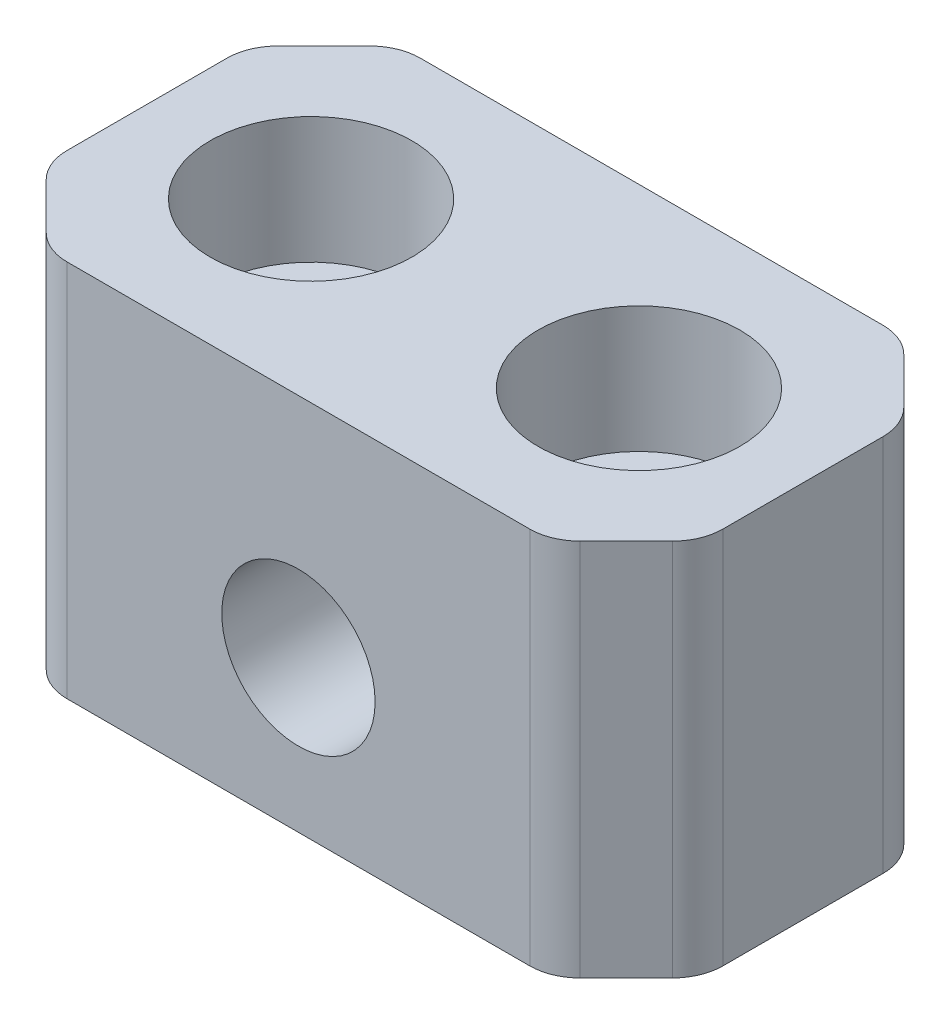
ISO-10303-21;
HEADER;
FILE_DESCRIPTION(('STEP AP214'),'2;1');
FILE_NAME('part.step','',(''),(''),'','','');
FILE_SCHEMA(('AUTOMOTIVE_DESIGN { 1 0 10303 214 1 1 1 1 }'));
ENDSEC;
DATA;
#1=APPLICATION_CONTEXT('core data for automotive mechanical design processes');
#2=APPLICATION_PROTOCOL_DEFINITION('international standard','automotive_design',2000,#1);
#3=PRODUCT_CONTEXT('',#1,'mechanical');
#4=PRODUCT('Part','Part','',(#3));
#5=PRODUCT_RELATED_PRODUCT_CATEGORY('part','',(#4));
#6=PRODUCT_DEFINITION_FORMATION('','',#4);
#7=PRODUCT_DEFINITION_CONTEXT('part definition',#1,'design');
#8=PRODUCT_DEFINITION('design','',#6,#7);
#9=PRODUCT_DEFINITION_SHAPE('','',#8);
#10=(LENGTH_UNIT() NAMED_UNIT(*) SI_UNIT(.MILLI.,.METRE.));
#11=(NAMED_UNIT(*) PLANE_ANGLE_UNIT() SI_UNIT($,.RADIAN.));
#12=(NAMED_UNIT(*) SI_UNIT($,.STERADIAN.) SOLID_ANGLE_UNIT());
#13=UNCERTAINTY_MEASURE_WITH_UNIT(LENGTH_MEASURE(1.E-05),#10,'distance_accuracy_value','');
#14=(GEOMETRIC_REPRESENTATION_CONTEXT(3) GLOBAL_UNCERTAINTY_ASSIGNED_CONTEXT((#13)) GLOBAL_UNIT_ASSIGNED_CONTEXT((#10,
#11,#12)) REPRESENTATION_CONTEXT('',''));
#15=CARTESIAN_POINT('',(0.,0.,0.));
#16=DIRECTION('',(0.,0.,1.));
#17=DIRECTION('',(1.,0.,0.));
#18=AXIS2_PLACEMENT_3D('',#15,#16,#17);
#19=CARTESIAN_POINT('',(-13.,7.5,-7.));
#20=DIRECTION('',(0.,0.,1.));
#21=DIRECTION('',(1.,0.,0.));
#22=AXIS2_PLACEMENT_3D('',#19,#20,#21);
#23=PLANE('',#22);
#24=DIRECTION('',(1.,0.,0.));
#25=VECTOR('',#24,1.);
#26=CARTESIAN_POINT('',(13.,-7.5,-7.));
#27=LINE('',#26,#25);
#28=CARTESIAN_POINT('',(-9.1715728752538,-7.5,-7.));
#29=VERTEX_POINT('',#28);
#30=CARTESIAN_POINT('',(9.1715728752538,-7.5,-7.));
#31=VERTEX_POINT('',#30);
#32=EDGE_CURVE('E170',#29,#31,#27,.T.);
#33=ORIENTED_EDGE('',*,*,#32,.F.);
#34=DIRECTION('',(0.,1.,0.));
#35=VECTOR('',#34,1.);
#36=CARTESIAN_POINT('',(-9.1715728752538,7.5,-7.));
#37=LINE('',#36,#35);
#38=CARTESIAN_POINT('',(-9.1715728752538,7.5,-7.));
#39=VERTEX_POINT('',#38);
#40=EDGE_CURVE('E168',#29,#39,#37,.T.);
#41=ORIENTED_EDGE('',*,*,#40,.T.);
#42=DIRECTION('',(-1.,0.,0.));
#43=VECTOR('',#42,1.);
#44=CARTESIAN_POINT('',(13.,7.5,-7.));
#45=LINE('',#44,#43);
#46=CARTESIAN_POINT('',(9.1715728752538,7.5,-7.));
#47=VERTEX_POINT('',#46);
#48=EDGE_CURVE('E151',#47,#39,#45,.T.);
#49=ORIENTED_EDGE('',*,*,#48,.F.);
#50=DIRECTION('',(0.,-1.,0.));
#51=VECTOR('',#50,1.);
#52=CARTESIAN_POINT('',(9.1715728752538,-7.5,-7.));
#53=LINE('',#52,#51);
#54=EDGE_CURVE('E165',#47,#31,#53,.T.);
#55=ORIENTED_EDGE('',*,*,#54,.T.);
#56=EDGE_LOOP('',(#33,#41,#49,#55));
#57=FACE_BOUND('',#56,.T.);
#58=CARTESIAN_POINT('',(0.,-1.5,-7.));
#59=DIRECTION('',(0.,0.,1.));
#60=DIRECTION('',(1.,0.,0.));
#61=AXIS2_PLACEMENT_3D('',#58,#59,#60);
#62=CIRCLE('',#61,3.04);
#63=CARTESIAN_POINT('',(3.04,-1.5,-7.));
#64=VERTEX_POINT('',#63);
#65=EDGE_CURVE('E269',#64,#64,#62,.T.);
#66=ORIENTED_EDGE('',*,*,#65,.T.);
#67=EDGE_LOOP('',(#66));
#68=FACE_BOUND('',#67,.T.);
#69=ADVANCED_FACE('F32',(#57,#68),#23,.F.);
#70=CARTESIAN_POINT('',(-13.,7.5,7.));
#71=DIRECTION('',(0.,0.,1.));
#72=DIRECTION('',(1.,0.,0.));
#73=AXIS2_PLACEMENT_3D('',#70,#71,#72);
#74=PLANE('',#73);
#75=DIRECTION('',(1.,0.,0.));
#76=VECTOR('',#75,1.);
#77=CARTESIAN_POINT('',(13.,-7.5,7.));
#78=LINE('',#77,#76);
#79=CARTESIAN_POINT('',(-9.1715728752538,-7.5,7.));
#80=VERTEX_POINT('',#79);
#81=CARTESIAN_POINT('',(9.17157287525381,-7.5,7.));
#82=VERTEX_POINT('',#81);
#83=EDGE_CURVE('E258',#80,#82,#78,.T.);
#84=ORIENTED_EDGE('',*,*,#83,.T.);
#85=DIRECTION('',(0.,-1.,0.));
#86=VECTOR('',#85,1.);
#87=CARTESIAN_POINT('',(9.17157287525381,7.5,7.));
#88=LINE('',#87,#86);
#89=CARTESIAN_POINT('',(9.17157287525381,7.5,7.));
#90=VERTEX_POINT('',#89);
#91=EDGE_CURVE('E233',#82,#90,#88,.F.);
#92=ORIENTED_EDGE('',*,*,#91,.T.);
#93=DIRECTION('',(-1.,0.,0.));
#94=VECTOR('',#93,1.);
#95=CARTESIAN_POINT('',(13.,7.5,7.));
#96=LINE('',#95,#94);
#97=CARTESIAN_POINT('',(-9.1715728752538,7.5,7.));
#98=VERTEX_POINT('',#97);
#99=EDGE_CURVE('E260',#90,#98,#96,.T.);
#100=ORIENTED_EDGE('',*,*,#99,.T.);
#101=DIRECTION('',(0.,1.,0.));
#102=VECTOR('',#101,1.);
#103=CARTESIAN_POINT('',(-9.17157287525381,7.5,7.));
#104=LINE('',#103,#102);
#105=EDGE_CURVE('E230',#98,#80,#104,.F.);
#106=ORIENTED_EDGE('',*,*,#105,.T.);
#107=EDGE_LOOP('',(#84,#92,#100,#106));
#108=FACE_BOUND('',#107,.T.);
#109=CARTESIAN_POINT('',(0.,-1.5,7.));
#110=DIRECTION('',(0.,0.,1.));
#111=DIRECTION('',(1.,0.,0.));
#112=AXIS2_PLACEMENT_3D('',#109,#110,#111);
#113=CIRCLE('',#112,3.04);
#114=CARTESIAN_POINT('',(3.04,-1.5,7.));
#115=VERTEX_POINT('',#114);
#116=EDGE_CURVE('E265',#115,#115,#113,.T.);
#117=ORIENTED_EDGE('',*,*,#116,.F.);
#118=EDGE_LOOP('',(#117));
#119=FACE_BOUND('',#118,.T.);
#120=ADVANCED_FACE('F256',(#108,#119),#74,.T.);
#121=CARTESIAN_POINT('',(-13.,-7.5,-7.));
#122=DIRECTION('',(-1.,0.,0.));
#123=DIRECTION('',(0.,0.,1.));
#124=AXIS2_PLACEMENT_3D('',#121,#122,#123);
#125=PLANE('',#124);
#126=DIRECTION('',(0.,0.,1.));
#127=VECTOR('',#126,1.);
#128=CARTESIAN_POINT('',(-13.,7.5,-7.));
#129=LINE('',#128,#127);
#130=CARTESIAN_POINT('',(-13.,7.5,-3.17157287525381));
#131=VERTEX_POINT('',#130);
#132=CARTESIAN_POINT('',(-13.,7.5,3.1715728752538));
#133=VERTEX_POINT('',#132);
#134=EDGE_CURVE('E250',#131,#133,#129,.T.);
#135=ORIENTED_EDGE('',*,*,#134,.F.);
#136=DIRECTION('',(0.,-1.,0.));
#137=VECTOR('',#136,1.);
#138=CARTESIAN_POINT('',(-13.,-7.5,-3.17157287525381));
#139=LINE('',#138,#137);
#140=CARTESIAN_POINT('',(-13.,-7.5,-3.17157287525381));
#141=VERTEX_POINT('',#140);
#142=EDGE_CURVE('E214',#131,#141,#139,.T.);
#143=ORIENTED_EDGE('',*,*,#142,.T.);
#144=DIRECTION('',(0.,0.,1.));
#145=VECTOR('',#144,1.);
#146=CARTESIAN_POINT('',(-13.,-7.5,-7.));
#147=LINE('',#146,#145);
#148=CARTESIAN_POINT('',(-13.,-7.5,3.1715728752538));
#149=VERTEX_POINT('',#148);
#150=EDGE_CURVE('E169',#141,#149,#147,.T.);
#151=ORIENTED_EDGE('',*,*,#150,.T.);
#152=DIRECTION('',(0.,-1.,0.));
#153=VECTOR('',#152,1.);
#154=CARTESIAN_POINT('',(-13.,-7.5,3.1715728752538));
#155=LINE('',#154,#153);
#156=EDGE_CURVE('E211',#149,#133,#155,.F.);
#157=ORIENTED_EDGE('',*,*,#156,.T.);
#158=EDGE_LOOP('',(#135,#143,#151,#157));
#159=FACE_BOUND('',#158,.T.);
#160=ADVANCED_FACE('F326',(#159),#125,.T.);
#161=CARTESIAN_POINT('',(13.,7.5,-7.));
#162=DIRECTION('',(0.,1.,0.));
#163=DIRECTION('',(-1.,0.,0.));
#164=AXIS2_PLACEMENT_3D('',#161,#162,#163);
#165=PLANE('',#164);
#166=CARTESIAN_POINT('',(6.5,7.5,0.));
#167=DIRECTION('',(0.,1.,0.));
#168=DIRECTION('',(0.,0.,-1.));
#169=AXIS2_PLACEMENT_3D('',#166,#167,#168);
#170=CIRCLE('',#169,4.);
#171=CARTESIAN_POINT('',(6.5,7.5,-4.));
#172=VERTEX_POINT('',#171);
#173=EDGE_CURVE('E471',#172,#172,#170,.T.);
#174=ORIENTED_EDGE('',*,*,#173,.F.);
#175=EDGE_LOOP('',(#174));
#176=FACE_BOUND('',#175,.T.);
#177=CARTESIAN_POINT('',(-6.5,7.5,0.));
#178=DIRECTION('',(0.,1.,0.));
#179=DIRECTION('',(0.,0.,1.));
#180=AXIS2_PLACEMENT_3D('',#177,#178,#179);
#181=CIRCLE('',#180,4.00000000000001);
#182=CARTESIAN_POINT('',(-6.5,7.5,4.00000000000001));
#183=VERTEX_POINT('',#182);
#184=EDGE_CURVE('E465',#183,#183,#181,.T.);
#185=ORIENTED_EDGE('',*,*,#184,.F.);
#186=EDGE_LOOP('',(#185));
#187=FACE_BOUND('',#186,.T.);
#188=ORIENTED_EDGE('',*,*,#48,.T.);
#189=CARTESIAN_POINT('',(-9.1715728752538,7.5,-5.));
#190=DIRECTION('',(0.,1.,0.));
#191=DIRECTION('',(-1.,0.,0.));
#192=AXIS2_PLACEMENT_3D('',#189,#190,#191);
#193=CIRCLE('',#192,2.);
#194=CARTESIAN_POINT('',(-10.5857864376269,7.5,-6.4142135623731));
#195=VERTEX_POINT('',#194);
#196=EDGE_CURVE('E192',#39,#195,#193,.T.);
#197=ORIENTED_EDGE('',*,*,#196,.T.);
#198=DIRECTION('',(-0.707106781186549,0.,0.707106781186546));
#199=VECTOR('',#198,1.);
#200=CARTESIAN_POINT('',(1.50000000000004,7.5,-18.5));
#201=LINE('',#200,#199);
#202=CARTESIAN_POINT('',(-12.4142135623731,7.5,-4.5857864376269));
#203=VERTEX_POINT('',#202);
#204=EDGE_CURVE('E249',#195,#203,#201,.T.);
#205=ORIENTED_EDGE('',*,*,#204,.T.);
#206=CARTESIAN_POINT('',(-11.,7.5,-3.17157287525381));
#207=DIRECTION('',(0.,1.,0.));
#208=DIRECTION('',(-1.,0.,0.));
#209=AXIS2_PLACEMENT_3D('',#206,#207,#208);
#210=CIRCLE('',#209,2.);
#211=EDGE_CURVE('E157',#203,#131,#210,.T.);
#212=ORIENTED_EDGE('',*,*,#211,.T.);
#213=ORIENTED_EDGE('',*,*,#134,.T.);
#214=CARTESIAN_POINT('',(-11.,7.5,3.1715728752538));
#215=DIRECTION('',(0.,1.,0.));
#216=DIRECTION('',(-1.,0.,0.));
#217=AXIS2_PLACEMENT_3D('',#214,#215,#216);
#218=CIRCLE('',#217,2.);
#219=CARTESIAN_POINT('',(-12.4142135623731,7.5,4.58578643762689));
#220=VERTEX_POINT('',#219);
#221=EDGE_CURVE('E184',#133,#220,#218,.T.);
#222=ORIENTED_EDGE('',*,*,#221,.T.);
#223=DIRECTION('',(-0.707106781186546,0.,-0.707106781186549));
#224=VECTOR('',#223,1.);
#225=CARTESIAN_POINT('',(-5.50000000000004,7.5,11.5));
#226=LINE('',#225,#224);
#227=CARTESIAN_POINT('',(-10.5857864376269,7.5,6.41421356237309));
#228=VERTEX_POINT('',#227);
#229=EDGE_CURVE('E241',#220,#228,#226,.F.);
#230=ORIENTED_EDGE('',*,*,#229,.T.);
#231=CARTESIAN_POINT('',(-9.17157287525381,7.5,5.));
#232=DIRECTION('',(0.,1.,0.));
#233=DIRECTION('',(-1.,0.,0.));
#234=AXIS2_PLACEMENT_3D('',#231,#232,#233);
#235=CIRCLE('',#234,2.);
#236=EDGE_CURVE('E176',#228,#98,#235,.T.);
#237=ORIENTED_EDGE('',*,*,#236,.T.);
#238=ORIENTED_EDGE('',*,*,#99,.F.);
#239=CARTESIAN_POINT('',(9.17157287525381,7.5,5.));
#240=DIRECTION('',(0.,1.,0.));
#241=DIRECTION('',(-1.,0.,0.));
#242=AXIS2_PLACEMENT_3D('',#239,#240,#241);
#243=CIRCLE('',#242,2.);
#244=CARTESIAN_POINT('',(10.5857864376269,7.5,6.41421356237309));
#245=VERTEX_POINT('',#244);
#246=EDGE_CURVE('E186',#90,#245,#243,.T.);
#247=ORIENTED_EDGE('',*,*,#246,.T.);
#248=DIRECTION('',(-0.707106781186546,0.,0.707106781186549));
#249=VECTOR('',#248,1.);
#250=CARTESIAN_POINT('',(18.5,7.5,-1.50000000000002));
#251=LINE('',#250,#249);
#252=CARTESIAN_POINT('',(12.4142135623731,7.5,4.5857864376269));
#253=VERTEX_POINT('',#252);
#254=EDGE_CURVE('E284',#245,#253,#251,.F.);
#255=ORIENTED_EDGE('',*,*,#254,.T.);
#256=CARTESIAN_POINT('',(11.,7.5,3.17157287525381));
#257=DIRECTION('',(0.,1.,0.));
#258=DIRECTION('',(-1.,0.,0.));
#259=AXIS2_PLACEMENT_3D('',#256,#257,#258);
#260=CIRCLE('',#259,2.);
#261=CARTESIAN_POINT('',(13.,7.5,3.17157287525381));
#262=VERTEX_POINT('',#261);
#263=EDGE_CURVE('E188',#253,#262,#260,.T.);
#264=ORIENTED_EDGE('',*,*,#263,.T.);
#265=DIRECTION('',(0.,0.,1.));
#266=VECTOR('',#265,1.);
#267=CARTESIAN_POINT('',(13.,7.5,-7.));
#268=LINE('',#267,#266);
#269=CARTESIAN_POINT('',(13.,7.5,-3.17157287525381));
#270=VERTEX_POINT('',#269);
#271=EDGE_CURVE('E275',#270,#262,#268,.T.);
#272=ORIENTED_EDGE('',*,*,#271,.F.);
#273=CARTESIAN_POINT('',(11.,7.5,-3.17157287525381));
#274=DIRECTION('',(0.,1.,0.));
#275=DIRECTION('',(-1.,0.,0.));
#276=AXIS2_PLACEMENT_3D('',#273,#274,#275);
#277=CIRCLE('',#276,2.);
#278=CARTESIAN_POINT('',(12.4142135623731,7.5,-4.58578643762691));
#279=VERTEX_POINT('',#278);
#280=EDGE_CURVE('E158',#270,#279,#277,.T.);
#281=ORIENTED_EDGE('',*,*,#280,.T.);
#282=DIRECTION('',(-0.707106781186549,0.,-0.707106781186546));
#283=VECTOR('',#282,1.);
#284=CARTESIAN_POINT('',(11.5,7.5,-5.5));
#285=LINE('',#284,#283);
#286=CARTESIAN_POINT('',(10.5857864376269,7.5,-6.4142135623731));
#287=VERTEX_POINT('',#286);
#288=EDGE_CURVE('E153',#279,#287,#285,.T.);
#289=ORIENTED_EDGE('',*,*,#288,.T.);
#290=CARTESIAN_POINT('',(9.1715728752538,7.5,-5.));
#291=DIRECTION('',(0.,1.,0.));
#292=DIRECTION('',(-1.,0.,0.));
#293=AXIS2_PLACEMENT_3D('',#290,#291,#292);
#294=CIRCLE('',#293,2.);
#295=EDGE_CURVE('E148',#287,#47,#294,.T.);
#296=ORIENTED_EDGE('',*,*,#295,.T.);
#297=EDGE_LOOP('',(#188,#197,#205,#212,#213,#222,#230,#237,#238,#247,#255,#264,#272,#281,#289,#296));
#298=FACE_BOUND('',#297,.T.);
#299=ADVANCED_FACE('F150',(#176,#187,#298),#165,.T.);
#300=CARTESIAN_POINT('',(13.,-7.5,-7.));
#301=DIRECTION('',(1.,0.,0.));
#302=DIRECTION('',(0.,0.,-1.));
#303=AXIS2_PLACEMENT_3D('',#300,#301,#302);
#304=PLANE('',#303);
#305=DIRECTION('',(0.,0.,1.));
#306=VECTOR('',#305,1.);
#307=CARTESIAN_POINT('',(13.,-7.5,-7.));
#308=LINE('',#307,#306);
#309=CARTESIAN_POINT('',(13.,-7.5,-3.17157287525381));
#310=VERTEX_POINT('',#309);
#311=CARTESIAN_POINT('',(13.,-7.5,3.17157287525381));
#312=VERTEX_POINT('',#311);
#313=EDGE_CURVE('E278',#310,#312,#308,.T.);
#314=ORIENTED_EDGE('',*,*,#313,.F.);
#315=DIRECTION('',(0.,1.,0.));
#316=VECTOR('',#315,1.);
#317=CARTESIAN_POINT('',(13.,-7.5,-3.17157287525381));
#318=LINE('',#317,#316);
#319=EDGE_CURVE('E223',#310,#270,#318,.T.);
#320=ORIENTED_EDGE('',*,*,#319,.T.);
#321=ORIENTED_EDGE('',*,*,#271,.T.);
#322=DIRECTION('',(0.,1.,0.));
#323=VECTOR('',#322,1.);
#324=CARTESIAN_POINT('',(13.,-7.5,3.17157287525381));
#325=LINE('',#324,#323);
#326=EDGE_CURVE('E220',#262,#312,#325,.F.);
#327=ORIENTED_EDGE('',*,*,#326,.T.);
#328=EDGE_LOOP('',(#314,#320,#321,#327));
#329=FACE_BOUND('',#328,.T.);
#330=ADVANCED_FACE('F305',(#329),#304,.T.);
#331=CARTESIAN_POINT('',(13.,-7.5,-7.));
#332=DIRECTION('',(0.,-1.,0.));
#333=DIRECTION('',(1.,0.,0.));
#334=AXIS2_PLACEMENT_3D('',#331,#332,#333);
#335=PLANE('',#334);
#336=CARTESIAN_POINT('',(-6.5,-7.5,0.));
#337=DIRECTION('',(0.,1.,0.));
#338=DIRECTION('',(0.,0.,1.));
#339=AXIS2_PLACEMENT_3D('',#336,#337,#338);
#340=CIRCLE('',#339,2.75);
#341=CARTESIAN_POINT('',(-6.5,-7.5,2.75));
#342=VERTEX_POINT('',#341);
#343=EDGE_CURVE('E480',#342,#342,#340,.T.);
#344=ORIENTED_EDGE('',*,*,#343,.T.);
#345=EDGE_LOOP('',(#344));
#346=FACE_BOUND('',#345,.T.);
#347=CARTESIAN_POINT('',(6.5,-7.5,0.));
#348=DIRECTION('',(0.,1.,0.));
#349=DIRECTION('',(0.,0.,1.));
#350=AXIS2_PLACEMENT_3D('',#347,#348,#349);
#351=CIRCLE('',#350,2.75);
#352=CARTESIAN_POINT('',(6.5,-7.5,2.75));
#353=VERTEX_POINT('',#352);
#354=EDGE_CURVE('E474',#353,#353,#351,.T.);
#355=ORIENTED_EDGE('',*,*,#354,.T.);
#356=EDGE_LOOP('',(#355));
#357=FACE_BOUND('',#356,.T.);
#358=DIRECTION('',(0.707106781186549,0.,-0.707106781186546));
#359=VECTOR('',#358,1.);
#360=CARTESIAN_POINT('',(1.50000000000004,-7.5,-18.5));
#361=LINE('',#360,#359);
#362=CARTESIAN_POINT('',(-12.4142135623731,-7.5,-4.5857864376269));
#363=VERTEX_POINT('',#362);
#364=CARTESIAN_POINT('',(-10.5857864376269,-7.5,-6.4142135623731));
#365=VERTEX_POINT('',#364);
#366=EDGE_CURVE('E289',#363,#365,#361,.T.);
#367=ORIENTED_EDGE('',*,*,#366,.T.);
#368=CARTESIAN_POINT('',(-9.1715728752538,-7.5,-5.));
#369=DIRECTION('',(0.,-1.,0.));
#370=DIRECTION('',(1.,0.,0.));
#371=AXIS2_PLACEMENT_3D('',#368,#369,#370);
#372=CIRCLE('',#371,2.);
#373=EDGE_CURVE('E209',#365,#29,#372,.T.);
#374=ORIENTED_EDGE('',*,*,#373,.T.);
#375=ORIENTED_EDGE('',*,*,#32,.T.);
#376=CARTESIAN_POINT('',(9.1715728752538,-7.5,-5.));
#377=DIRECTION('',(0.,-1.,0.));
#378=DIRECTION('',(1.,0.,0.));
#379=AXIS2_PLACEMENT_3D('',#376,#377,#378);
#380=CIRCLE('',#379,2.);
#381=CARTESIAN_POINT('',(10.5857864376269,-7.5,-6.4142135623731));
#382=VERTEX_POINT('',#381);
#383=EDGE_CURVE('E173',#31,#382,#380,.T.);
#384=ORIENTED_EDGE('',*,*,#383,.T.);
#385=DIRECTION('',(0.707106781186549,0.,0.707106781186546));
#386=VECTOR('',#385,1.);
#387=CARTESIAN_POINT('',(11.5,-7.5,-5.5));
#388=LINE('',#387,#386);
#389=CARTESIAN_POINT('',(12.4142135623731,-7.5,-4.58578643762691));
#390=VERTEX_POINT('',#389);
#391=EDGE_CURVE('E174',#382,#390,#388,.T.);
#392=ORIENTED_EDGE('',*,*,#391,.T.);
#393=CARTESIAN_POINT('',(11.,-7.5,-3.17157287525381));
#394=DIRECTION('',(0.,-1.,0.));
#395=DIRECTION('',(1.,0.,0.));
#396=AXIS2_PLACEMENT_3D('',#393,#394,#395);
#397=CIRCLE('',#396,2.);
#398=EDGE_CURVE('E205',#390,#310,#397,.T.);
#399=ORIENTED_EDGE('',*,*,#398,.T.);
#400=ORIENTED_EDGE('',*,*,#313,.T.);
#401=CARTESIAN_POINT('',(11.,-7.5,3.17157287525381));
#402=DIRECTION('',(0.,-1.,0.));
#403=DIRECTION('',(1.,0.,0.));
#404=AXIS2_PLACEMENT_3D('',#401,#402,#403);
#405=CIRCLE('',#404,2.);
#406=CARTESIAN_POINT('',(12.4142135623731,-7.5,4.5857864376269));
#407=VERTEX_POINT('',#406);
#408=EDGE_CURVE('E203',#312,#407,#405,.T.);
#409=ORIENTED_EDGE('',*,*,#408,.T.);
#410=DIRECTION('',(0.707106781186546,0.,-0.707106781186549));
#411=VECTOR('',#410,1.);
#412=CARTESIAN_POINT('',(18.5,-7.5,-1.50000000000002));
#413=LINE('',#412,#411);
#414=CARTESIAN_POINT('',(10.5857864376269,-7.5,6.41421356237309));
#415=VERTEX_POINT('',#414);
#416=EDGE_CURVE('E179',#407,#415,#413,.F.);
#417=ORIENTED_EDGE('',*,*,#416,.T.);
#418=CARTESIAN_POINT('',(9.17157287525381,-7.5,5.));
#419=DIRECTION('',(0.,-1.,0.));
#420=DIRECTION('',(1.,0.,0.));
#421=AXIS2_PLACEMENT_3D('',#418,#419,#420);
#422=CIRCLE('',#421,2.);
#423=EDGE_CURVE('E201',#415,#82,#422,.T.);
#424=ORIENTED_EDGE('',*,*,#423,.T.);
#425=ORIENTED_EDGE('',*,*,#83,.F.);
#426=CARTESIAN_POINT('',(-9.17157287525381,-7.5,5.));
#427=DIRECTION('',(0.,-1.,0.));
#428=DIRECTION('',(1.,0.,0.));
#429=AXIS2_PLACEMENT_3D('',#426,#427,#428);
#430=CIRCLE('',#429,2.);
#431=CARTESIAN_POINT('',(-10.5857864376269,-7.5,6.41421356237309));
#432=VERTEX_POINT('',#431);
#433=EDGE_CURVE('E198',#80,#432,#430,.T.);
#434=ORIENTED_EDGE('',*,*,#433,.T.);
#435=DIRECTION('',(0.707106781186546,0.,0.707106781186549));
#436=VECTOR('',#435,1.);
#437=CARTESIAN_POINT('',(-5.50000000000004,-7.5,11.5));
#438=LINE('',#437,#436);
#439=CARTESIAN_POINT('',(-12.4142135623731,-7.5,4.58578643762689));
#440=VERTEX_POINT('',#439);
#441=EDGE_CURVE('E243',#432,#440,#438,.F.);
#442=ORIENTED_EDGE('',*,*,#441,.T.);
#443=CARTESIAN_POINT('',(-11.,-7.5,3.1715728752538));
#444=DIRECTION('',(0.,-1.,0.));
#445=DIRECTION('',(1.,0.,0.));
#446=AXIS2_PLACEMENT_3D('',#443,#444,#445);
#447=CIRCLE('',#446,2.);
#448=EDGE_CURVE('E47',#440,#149,#447,.T.);
#449=ORIENTED_EDGE('',*,*,#448,.T.);
#450=ORIENTED_EDGE('',*,*,#150,.F.);
#451=CARTESIAN_POINT('',(-11.,-7.5,-3.17157287525381));
#452=DIRECTION('',(0.,-1.,0.));
#453=DIRECTION('',(1.,0.,0.));
#454=AXIS2_PLACEMENT_3D('',#451,#452,#453);
#455=CIRCLE('',#454,2.);
#456=EDGE_CURVE('E55',#141,#363,#455,.T.);
#457=ORIENTED_EDGE('',*,*,#456,.T.);
#458=EDGE_LOOP('',(#367,#374,#375,#384,#392,#399,#400,#409,#417,#424,#425,#434,#442,#449,#450,#457));
#459=FACE_BOUND('',#458,.T.);
#460=ADVANCED_FACE('F262',(#346,#357,#459),#335,.T.);
#461=CARTESIAN_POINT('',(0.,-1.5,7.));
#462=DIRECTION('',(0.,0.,-1.));
#463=DIRECTION('',(-1.,0.,0.));
#464=AXIS2_PLACEMENT_3D('',#461,#462,#463);
#465=CYLINDRICAL_SURFACE('',#464,3.04);
#466=ORIENTED_EDGE('',*,*,#116,.T.);
#467=EDGE_LOOP('',(#466));
#468=FACE_BOUND('',#467,.T.);
#469=ORIENTED_EDGE('',*,*,#65,.F.);
#470=EDGE_LOOP('',(#469));
#471=FACE_BOUND('',#470,.T.);
#472=ADVANCED_FACE('F352',(#468,#471),#465,.F.);
#473=CARTESIAN_POINT('',(-6.5,2.5,0.));
#474=DIRECTION('',(0.,1.,0.));
#475=DIRECTION('',(0.,0.,1.));
#476=AXIS2_PLACEMENT_3D('',#473,#474,#475);
#477=CYLINDRICAL_SURFACE('',#476,4.00000000000001);
#478=CARTESIAN_POINT('',(-6.5,2.5,0.));
#479=DIRECTION('',(0.,1.,0.));
#480=DIRECTION('',(0.,0.,1.));
#481=AXIS2_PLACEMENT_3D('',#478,#479,#480);
#482=CIRCLE('',#481,4.00000000000001);
#483=CARTESIAN_POINT('',(-6.5,2.5,4.00000000000001));
#484=VERTEX_POINT('',#483);
#485=EDGE_CURVE('E463',#484,#484,#482,.T.);
#486=ORIENTED_EDGE('',*,*,#485,.F.);
#487=EDGE_LOOP('',(#486));
#488=FACE_BOUND('',#487,.T.);
#489=ORIENTED_EDGE('',*,*,#184,.T.);
#490=EDGE_LOOP('',(#489));
#491=FACE_BOUND('',#490,.T.);
#492=ADVANCED_FACE('F436',(#488,#491),#477,.F.);
#493=CARTESIAN_POINT('',(-6.5,2.5,0.));
#494=DIRECTION('',(0.,1.,0.));
#495=DIRECTION('',(0.,0.,1.));
#496=AXIS2_PLACEMENT_3D('',#493,#494,#495);
#497=PLANE('',#496);
#498=CARTESIAN_POINT('',(-6.5,2.5,0.));
#499=DIRECTION('',(0.,1.,0.));
#500=DIRECTION('',(0.,0.,1.));
#501=AXIS2_PLACEMENT_3D('',#498,#499,#500);
#502=CIRCLE('',#501,2.75);
#503=CARTESIAN_POINT('',(-6.5,2.5,2.75));
#504=VERTEX_POINT('',#503);
#505=EDGE_CURVE('E483',#504,#504,#502,.T.);
#506=ORIENTED_EDGE('',*,*,#505,.F.);
#507=EDGE_LOOP('',(#506));
#508=FACE_BOUND('',#507,.T.);
#509=ORIENTED_EDGE('',*,*,#485,.T.);
#510=EDGE_LOOP('',(#509));
#511=FACE_BOUND('',#510,.T.);
#512=ADVANCED_FACE('F431',(#508,#511),#497,.T.);
#513=CARTESIAN_POINT('',(6.5,2.5,0.));
#514=DIRECTION('',(0.,1.,0.));
#515=DIRECTION('',(0.,0.,1.));
#516=AXIS2_PLACEMENT_3D('',#513,#514,#515);
#517=CYLINDRICAL_SURFACE('',#516,4.);
#518=CARTESIAN_POINT('',(6.5,2.5,0.));
#519=DIRECTION('',(0.,1.,0.));
#520=DIRECTION('',(0.,0.,-1.));
#521=AXIS2_PLACEMENT_3D('',#518,#519,#520);
#522=CIRCLE('',#521,4.);
#523=CARTESIAN_POINT('',(6.5,2.5,-4.));
#524=VERTEX_POINT('',#523);
#525=EDGE_CURVE('E469',#524,#524,#522,.T.);
#526=ORIENTED_EDGE('',*,*,#525,.F.);
#527=EDGE_LOOP('',(#526));
#528=FACE_BOUND('',#527,.T.);
#529=ORIENTED_EDGE('',*,*,#173,.T.);
#530=EDGE_LOOP('',(#529));
#531=FACE_BOUND('',#530,.T.);
#532=ADVANCED_FACE('F403',(#528,#531),#517,.F.);
#533=CARTESIAN_POINT('',(6.5,2.5,0.));
#534=DIRECTION('',(0.,-1.,0.));
#535=DIRECTION('',(0.,0.,-1.));
#536=AXIS2_PLACEMENT_3D('',#533,#534,#535);
#537=PLANE('',#536);
#538=CARTESIAN_POINT('',(6.5,2.5,0.));
#539=DIRECTION('',(0.,1.,0.));
#540=DIRECTION('',(0.,0.,1.));
#541=AXIS2_PLACEMENT_3D('',#538,#539,#540);
#542=CIRCLE('',#541,2.75);
#543=CARTESIAN_POINT('',(6.5,2.5,2.75));
#544=VERTEX_POINT('',#543);
#545=EDGE_CURVE('E477',#544,#544,#542,.T.);
#546=ORIENTED_EDGE('',*,*,#545,.F.);
#547=EDGE_LOOP('',(#546));
#548=FACE_BOUND('',#547,.T.);
#549=ORIENTED_EDGE('',*,*,#525,.T.);
#550=EDGE_LOOP('',(#549));
#551=FACE_BOUND('',#550,.T.);
#552=ADVANCED_FACE('F358',(#548,#551),#537,.F.);
#553=CARTESIAN_POINT('',(13.,-7.5,-4.));
#554=DIRECTION('',(0.707106781186546,0.,-0.707106781186549));
#555=DIRECTION('',(-0.707106781186549,0.,-0.707106781186546));
#556=AXIS2_PLACEMENT_3D('',#553,#554,#555);
#557=PLANE('',#556);
#558=ORIENTED_EDGE('',*,*,#391,.F.);
#559=DIRECTION('',(0.,-1.,0.));
#560=VECTOR('',#559,1.);
#561=CARTESIAN_POINT('',(10.5857864376269,7.5,-6.4142135623731));
#562=LINE('',#561,#560);
#563=EDGE_CURVE('E218',#382,#287,#562,.F.);
#564=ORIENTED_EDGE('',*,*,#563,.T.);
#565=ORIENTED_EDGE('',*,*,#288,.F.);
#566=DIRECTION('',(0.,1.,0.));
#567=VECTOR('',#566,1.);
#568=CARTESIAN_POINT('',(12.4142135623731,-7.5,-4.58578643762691));
#569=LINE('',#568,#567);
#570=EDGE_CURVE('E216',#279,#390,#569,.F.);
#571=ORIENTED_EDGE('',*,*,#570,.T.);
#572=EDGE_LOOP('',(#558,#564,#565,#571));
#573=FACE_BOUND('',#572,.T.);
#574=ADVANCED_FACE('F313',(#573),#557,.T.);
#575=CARTESIAN_POINT('',(10.,7.5,7.));
#576=DIRECTION('',(-0.707106781186549,0.,-0.707106781186546));
#577=DIRECTION('',(-0.707106781186546,0.,0.707106781186549));
#578=AXIS2_PLACEMENT_3D('',#575,#576,#577);
#579=PLANE('',#578);
#580=ORIENTED_EDGE('',*,*,#416,.F.);
#581=DIRECTION('',(0.,-1.,0.));
#582=VECTOR('',#581,1.);
#583=CARTESIAN_POINT('',(12.4142135623731,7.5,4.5857864376269));
#584=LINE('',#583,#582);
#585=EDGE_CURVE('E228',#407,#253,#584,.F.);
#586=ORIENTED_EDGE('',*,*,#585,.T.);
#587=ORIENTED_EDGE('',*,*,#254,.F.);
#588=DIRECTION('',(0.,1.,0.));
#589=VECTOR('',#588,1.);
#590=CARTESIAN_POINT('',(10.5857864376269,7.5,6.41421356237309));
#591=LINE('',#590,#589);
#592=EDGE_CURVE('E226',#245,#415,#591,.F.);
#593=ORIENTED_EDGE('',*,*,#592,.T.);
#594=EDGE_LOOP('',(#580,#586,#587,#593));
#595=FACE_BOUND('',#594,.T.);
#596=ADVANCED_FACE('F298',(#595),#579,.F.);
#597=CARTESIAN_POINT('',(-13.,-7.5,-4.));
#598=DIRECTION('',(-0.707106781186546,0.,-0.707106781186549));
#599=DIRECTION('',(-0.707106781186549,0.,0.707106781186546));
#600=AXIS2_PLACEMENT_3D('',#597,#598,#599);
#601=PLANE('',#600);
#602=ORIENTED_EDGE('',*,*,#204,.F.);
#603=DIRECTION('',(0.,1.,0.));
#604=VECTOR('',#603,1.);
#605=CARTESIAN_POINT('',(-10.5857864376269,-7.5,-6.4142135623731));
#606=LINE('',#605,#604);
#607=EDGE_CURVE('E196',#195,#365,#606,.F.);
#608=ORIENTED_EDGE('',*,*,#607,.T.);
#609=ORIENTED_EDGE('',*,*,#366,.F.);
#610=DIRECTION('',(0.,-1.,0.));
#611=VECTOR('',#610,1.);
#612=CARTESIAN_POINT('',(-12.4142135623731,-7.5,-4.58578643762691));
#613=LINE('',#612,#611);
#614=EDGE_CURVE('E194',#363,#203,#613,.F.);
#615=ORIENTED_EDGE('',*,*,#614,.T.);
#616=EDGE_LOOP('',(#602,#608,#609,#615));
#617=FACE_BOUND('',#616,.T.);
#618=ADVANCED_FACE('F321',(#617),#601,.T.);
#619=CARTESIAN_POINT('',(-10.,7.5,7.));
#620=DIRECTION('',(0.707106781186549,0.,-0.707106781186546));
#621=DIRECTION('',(-0.707106781186546,0.,-0.707106781186549));
#622=AXIS2_PLACEMENT_3D('',#619,#620,#621);
#623=PLANE('',#622);
#624=ORIENTED_EDGE('',*,*,#229,.F.);
#625=DIRECTION('',(0.,1.,0.));
#626=VECTOR('',#625,1.);
#627=CARTESIAN_POINT('',(-12.4142135623731,7.5,4.58578643762689));
#628=LINE('',#627,#626);
#629=EDGE_CURVE('E11',#220,#440,#628,.F.);
#630=ORIENTED_EDGE('',*,*,#629,.T.);
#631=ORIENTED_EDGE('',*,*,#441,.F.);
#632=DIRECTION('',(0.,-1.,0.));
#633=VECTOR('',#632,1.);
#634=CARTESIAN_POINT('',(-10.5857864376269,7.5,6.41421356237309));
#635=LINE('',#634,#633);
#636=EDGE_CURVE('E40',#432,#228,#635,.F.);
#637=ORIENTED_EDGE('',*,*,#636,.T.);
#638=EDGE_LOOP('',(#624,#630,#631,#637));
#639=FACE_BOUND('',#638,.T.);
#640=ADVANCED_FACE('F240',(#639),#623,.F.);
#641=CARTESIAN_POINT('',(-9.1715728752538,7.5,-5.));
#642=DIRECTION('',(0.,-1.,0.));
#643=DIRECTION('',(0.,0.,-1.));
#644=AXIS2_PLACEMENT_3D('',#641,#642,#643);
#645=CYLINDRICAL_SURFACE('',#644,2.);
#646=ORIENTED_EDGE('',*,*,#373,.F.);
#647=ORIENTED_EDGE('',*,*,#607,.F.);
#648=ORIENTED_EDGE('',*,*,#196,.F.);
#649=ORIENTED_EDGE('',*,*,#40,.F.);
#650=EDGE_LOOP('',(#646,#647,#648,#649));
#651=FACE_BOUND('',#650,.T.);
#652=ADVANCED_FACE('F316',(#651),#645,.T.);
#653=CARTESIAN_POINT('',(-11.,-7.5,-3.17157287525381));
#654=DIRECTION('',(0.,-1.,0.));
#655=DIRECTION('',(0.,0.,-1.));
#656=AXIS2_PLACEMENT_3D('',#653,#654,#655);
#657=CYLINDRICAL_SURFACE('',#656,2.);
#658=ORIENTED_EDGE('',*,*,#211,.F.);
#659=ORIENTED_EDGE('',*,*,#614,.F.);
#660=ORIENTED_EDGE('',*,*,#456,.F.);
#661=ORIENTED_EDGE('',*,*,#142,.F.);
#662=EDGE_LOOP('',(#658,#659,#660,#661));
#663=FACE_BOUND('',#662,.T.);
#664=ADVANCED_FACE('F323',(#663),#657,.T.);
#665=CARTESIAN_POINT('',(9.1715728752538,7.5,-5.));
#666=DIRECTION('',(0.,1.,0.));
#667=DIRECTION('',(0.,0.,1.));
#668=AXIS2_PLACEMENT_3D('',#665,#666,#667);
#669=CYLINDRICAL_SURFACE('',#668,2.);
#670=ORIENTED_EDGE('',*,*,#295,.F.);
#671=ORIENTED_EDGE('',*,*,#563,.F.);
#672=ORIENTED_EDGE('',*,*,#383,.F.);
#673=ORIENTED_EDGE('',*,*,#54,.F.);
#674=EDGE_LOOP('',(#670,#671,#672,#673));
#675=FACE_BOUND('',#674,.T.);
#676=ADVANCED_FACE('F172',(#675),#669,.T.);
#677=CARTESIAN_POINT('',(11.,-7.5,-3.17157287525381));
#678=DIRECTION('',(0.,1.,0.));
#679=DIRECTION('',(0.,0.,1.));
#680=AXIS2_PLACEMENT_3D('',#677,#678,#679);
#681=CYLINDRICAL_SURFACE('',#680,2.);
#682=ORIENTED_EDGE('',*,*,#398,.F.);
#683=ORIENTED_EDGE('',*,*,#570,.F.);
#684=ORIENTED_EDGE('',*,*,#280,.F.);
#685=ORIENTED_EDGE('',*,*,#319,.F.);
#686=EDGE_LOOP('',(#682,#683,#684,#685));
#687=FACE_BOUND('',#686,.T.);
#688=ADVANCED_FACE('F309',(#687),#681,.T.);
#689=CARTESIAN_POINT('',(11.,-7.5,3.17157287525381));
#690=DIRECTION('',(0.,1.,0.));
#691=DIRECTION('',(0.,0.,1.));
#692=AXIS2_PLACEMENT_3D('',#689,#690,#691);
#693=CYLINDRICAL_SURFACE('',#692,2.);
#694=ORIENTED_EDGE('',*,*,#263,.F.);
#695=ORIENTED_EDGE('',*,*,#585,.F.);
#696=ORIENTED_EDGE('',*,*,#408,.F.);
#697=ORIENTED_EDGE('',*,*,#326,.F.);
#698=EDGE_LOOP('',(#694,#695,#696,#697));
#699=FACE_BOUND('',#698,.T.);
#700=ADVANCED_FACE('F300',(#699),#693,.T.);
#701=CARTESIAN_POINT('',(9.17157287525381,7.5,5.));
#702=DIRECTION('',(0.,-1.,0.));
#703=DIRECTION('',(0.,0.,-1.));
#704=AXIS2_PLACEMENT_3D('',#701,#702,#703);
#705=CYLINDRICAL_SURFACE('',#704,2.);
#706=ORIENTED_EDGE('',*,*,#423,.F.);
#707=ORIENTED_EDGE('',*,*,#592,.F.);
#708=ORIENTED_EDGE('',*,*,#246,.F.);
#709=ORIENTED_EDGE('',*,*,#91,.F.);
#710=EDGE_LOOP('',(#706,#707,#708,#709));
#711=FACE_BOUND('',#710,.T.);
#712=ADVANCED_FACE('F295',(#711),#705,.T.);
#713=CARTESIAN_POINT('',(-11.,-7.5,3.1715728752538));
#714=DIRECTION('',(0.,-1.,0.));
#715=DIRECTION('',(0.,0.,-1.));
#716=AXIS2_PLACEMENT_3D('',#713,#714,#715);
#717=CYLINDRICAL_SURFACE('',#716,2.);
#718=ORIENTED_EDGE('',*,*,#448,.F.);
#719=ORIENTED_EDGE('',*,*,#629,.F.);
#720=ORIENTED_EDGE('',*,*,#221,.F.);
#721=ORIENTED_EDGE('',*,*,#156,.F.);
#722=EDGE_LOOP('',(#718,#719,#720,#721));
#723=FACE_BOUND('',#722,.T.);
#724=ADVANCED_FACE('F329',(#723),#717,.T.);
#725=CARTESIAN_POINT('',(-9.17157287525381,7.5,5.));
#726=DIRECTION('',(0.,1.,0.));
#727=DIRECTION('',(0.,0.,1.));
#728=AXIS2_PLACEMENT_3D('',#725,#726,#727);
#729=CYLINDRICAL_SURFACE('',#728,2.);
#730=ORIENTED_EDGE('',*,*,#236,.F.);
#731=ORIENTED_EDGE('',*,*,#636,.F.);
#732=ORIENTED_EDGE('',*,*,#433,.F.);
#733=ORIENTED_EDGE('',*,*,#105,.F.);
#734=EDGE_LOOP('',(#730,#731,#732,#733));
#735=FACE_BOUND('',#734,.T.);
#736=ADVANCED_FACE('F34',(#735),#729,.T.);
#737=CARTESIAN_POINT('',(6.5,-7.5,0.));
#738=DIRECTION('',(0.,1.,0.));
#739=DIRECTION('',(0.,0.,1.));
#740=AXIS2_PLACEMENT_3D('',#737,#738,#739);
#741=CYLINDRICAL_SURFACE('',#740,2.75);
#742=ORIENTED_EDGE('',*,*,#354,.F.);
#743=EDGE_LOOP('',(#742));
#744=FACE_BOUND('',#743,.T.);
#745=ORIENTED_EDGE('',*,*,#545,.T.);
#746=EDGE_LOOP('',(#745));
#747=FACE_BOUND('',#746,.T.);
#748=ADVANCED_FACE('F335',(#744,#747),#741,.F.);
#749=CARTESIAN_POINT('',(-6.5,-7.5,0.));
#750=DIRECTION('',(0.,1.,0.));
#751=DIRECTION('',(0.,0.,1.));
#752=AXIS2_PLACEMENT_3D('',#749,#750,#751);
#753=CYLINDRICAL_SURFACE('',#752,2.75);
#754=ORIENTED_EDGE('',*,*,#343,.F.);
#755=EDGE_LOOP('',(#754));
#756=FACE_BOUND('',#755,.T.);
#757=ORIENTED_EDGE('',*,*,#505,.T.);
#758=EDGE_LOOP('',(#757));
#759=FACE_BOUND('',#758,.T.);
#760=ADVANCED_FACE('F414',(#756,#759),#753,.F.);
#761=CLOSED_SHELL('',(#69,#120,#160,#299,#330,#460,#472,#492,#512,#532,#552,#574,#596,#618,#640,
#652,#664,#676,#688,#700,#712,#724,#736,#748,#760));
#762=MANIFOLD_SOLID_BREP('B2',#761);
#763=ADVANCED_BREP_SHAPE_REPRESENTATION('',(#18,#762),#14);
#764=SHAPE_DEFINITION_REPRESENTATION(#9,#763);
ENDSEC;
END-ISO-10303-21;
